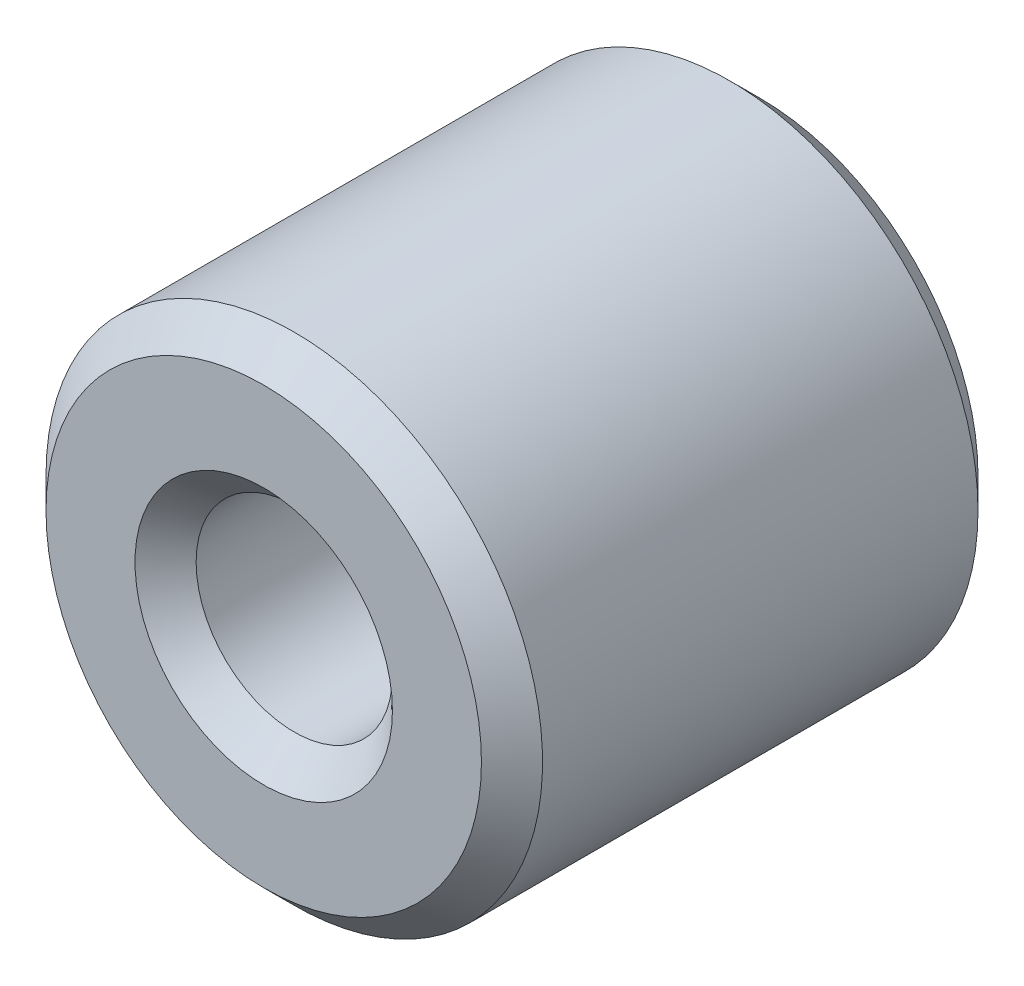
ISO-10303-21;
HEADER;
FILE_DESCRIPTION(('STEP AP214'),'2;1');
FILE_NAME('part.step','',(''),(''),'','','');
FILE_SCHEMA(('AUTOMOTIVE_DESIGN { 1 0 10303 214 1 1 1 1 }'));
ENDSEC;
DATA;
#1=APPLICATION_CONTEXT('core data for automotive mechanical design processes');
#2=APPLICATION_PROTOCOL_DEFINITION('international standard','automotive_design',2000,#1);
#3=PRODUCT_CONTEXT('',#1,'mechanical');
#4=PRODUCT('Part','Part','',(#3));
#5=PRODUCT_RELATED_PRODUCT_CATEGORY('part','',(#4));
#6=PRODUCT_DEFINITION_FORMATION('','',#4);
#7=PRODUCT_DEFINITION_CONTEXT('part definition',#1,'design');
#8=PRODUCT_DEFINITION('design','',#6,#7);
#9=PRODUCT_DEFINITION_SHAPE('','',#8);
#10=(LENGTH_UNIT() NAMED_UNIT(*) SI_UNIT(.MILLI.,.METRE.));
#11=(NAMED_UNIT(*) PLANE_ANGLE_UNIT() SI_UNIT($,.RADIAN.));
#12=(NAMED_UNIT(*) SI_UNIT($,.STERADIAN.) SOLID_ANGLE_UNIT());
#13=UNCERTAINTY_MEASURE_WITH_UNIT(LENGTH_MEASURE(1.E-05),#10,'distance_accuracy_value','');
#14=(GEOMETRIC_REPRESENTATION_CONTEXT(3) GLOBAL_UNCERTAINTY_ASSIGNED_CONTEXT((#13)) GLOBAL_UNIT_ASSIGNED_CONTEXT((#10,
#11,#12)) REPRESENTATION_CONTEXT('',''));
#15=CARTESIAN_POINT('',(0.,0.,0.));
#16=DIRECTION('',(0.,0.,1.));
#17=DIRECTION('',(1.,0.,0.));
#18=AXIS2_PLACEMENT_3D('',#15,#16,#17);
#19=CARTESIAN_POINT('',(0.,0.,13.));
#20=DIRECTION('',(0.,0.,-1.));
#21=DIRECTION('',(-1.,0.,0.));
#22=AXIS2_PLACEMENT_3D('',#19,#20,#21);
#23=CYLINDRICAL_SURFACE('',#22,2.57);
#24=CARTESIAN_POINT('',(0.,0.,0.800000000026557));
#25=DIRECTION('',(0.,0.,-1.));
#26=DIRECTION('',(-1.,0.,0.));
#27=AXIS2_PLACEMENT_3D('',#24,#25,#26);
#28=CIRCLE('',#27,2.56999999999152);
#29=CARTESIAN_POINT('',(-2.56999999999152,0.,0.800000000026557));
#30=VERTEX_POINT('',#29);
#31=EDGE_CURVE('E30',#30,#30,#28,.T.);
#32=ORIENTED_EDGE('',*,*,#31,.T.);
#33=EDGE_LOOP('',(#32));
#34=FACE_BOUND('',#33,.T.);
#35=CARTESIAN_POINT('',(0.,0.,12.2000000000071));
#36=DIRECTION('',(0.,0.,1.));
#37=DIRECTION('',(1.,0.,0.));
#38=AXIS2_PLACEMENT_3D('',#35,#36,#37);
#39=CIRCLE('',#38,2.56999999999152);
#40=CARTESIAN_POINT('',(2.56999999999152,0.,12.2000000000071));
#41=VERTEX_POINT('',#40);
#42=EDGE_CURVE('E33',#41,#41,#39,.T.);
#43=ORIENTED_EDGE('',*,*,#42,.T.);
#44=EDGE_LOOP('',(#43));
#45=FACE_BOUND('',#44,.T.);
#46=ADVANCED_FACE('F15',(#34,#45),#23,.F.);
#47=CARTESIAN_POINT('',(0.,0.,12.9999999999768));
#48=DIRECTION('',(0.,0.,1.));
#49=DIRECTION('',(1.,0.,0.));
#50=AXIS2_PLACEMENT_3D('',#47,#48,#49);
#51=CONICAL_SURFACE('',#50,3.36999999996124,0.785398163397448);
#52=ORIENTED_EDGE('',*,*,#42,.F.);
#53=EDGE_LOOP('',(#52));
#54=FACE_BOUND('',#53,.T.);
#55=CARTESIAN_POINT('',(0.,0.,12.9999999999768));
#56=DIRECTION('',(0.,0.,1.));
#57=DIRECTION('',(1.,0.,0.));
#58=AXIS2_PLACEMENT_3D('',#55,#56,#57);
#59=CIRCLE('',#58,3.36999999996124);
#60=CARTESIAN_POINT('',(3.36999999996124,0.,12.9999999999768));
#61=VERTEX_POINT('',#60);
#62=EDGE_CURVE('E18',#61,#61,#59,.F.);
#63=ORIENTED_EDGE('',*,*,#62,.F.);
#64=EDGE_LOOP('',(#63));
#65=FACE_BOUND('',#64,.T.);
#66=ADVANCED_FACE('F49',(#54,#65),#51,.F.);
#67=CARTESIAN_POINT('',(0.,0.,1.13686837721616E-10));
#68=DIRECTION('',(0.,0.,-1.));
#69=DIRECTION('',(-1.,0.,0.));
#70=AXIS2_PLACEMENT_3D('',#67,#68,#69);
#71=CONICAL_SURFACE('',#70,3.36999999990439,0.785398163397448);
#72=CARTESIAN_POINT('',(0.,0.,5.6843418860808E-11));
#73=DIRECTION('',(0.,0.,-1.));
#74=DIRECTION('',(-1.,0.,0.));
#75=AXIS2_PLACEMENT_3D('',#72,#73,#74);
#76=CIRCLE('',#75,3.36999999996124);
#77=CARTESIAN_POINT('',(-3.36999999996124,0.,5.6843418860808E-11));
#78=VERTEX_POINT('',#77);
#79=EDGE_CURVE('E40',#78,#78,#76,.T.);
#80=ORIENTED_EDGE('',*,*,#79,.T.);
#81=EDGE_LOOP('',(#80));
#82=FACE_BOUND('',#81,.T.);
#83=ORIENTED_EDGE('',*,*,#31,.F.);
#84=EDGE_LOOP('',(#83));
#85=FACE_BOUND('',#84,.T.);
#86=ADVANCED_FACE('F51',(#82,#85),#71,.F.);
#87=CARTESIAN_POINT('',(0.,0.,13.));
#88=DIRECTION('',(0.,0.,1.));
#89=DIRECTION('',(1.,0.,0.));
#90=AXIS2_PLACEMENT_3D('',#87,#88,#89);
#91=PLANE('',#90);
#92=CARTESIAN_POINT('',(0.,0.,12.9999999999768));
#93=DIRECTION('',(0.,0.,-1.));
#94=DIRECTION('',(-1.,0.,0.));
#95=AXIS2_PLACEMENT_3D('',#92,#93,#94);
#96=CIRCLE('',#95,5.69999999993342);
#97=CARTESIAN_POINT('',(-5.69999999993342,0.,12.9999999999768));
#98=VERTEX_POINT('',#97);
#99=EDGE_CURVE('E38',#98,#98,#96,.T.);
#100=ORIENTED_EDGE('',*,*,#99,.F.);
#101=EDGE_LOOP('',(#100));
#102=FACE_BOUND('',#101,.T.);
#103=ORIENTED_EDGE('',*,*,#62,.T.);
#104=EDGE_LOOP('',(#103));
#105=FACE_BOUND('',#104,.T.);
#106=ADVANCED_FACE('F47',(#102,#105),#91,.T.);
#107=CARTESIAN_POINT('',(0.,0.,0.));
#108=DIRECTION('',(0.,0.,1.));
#109=DIRECTION('',(1.,0.,0.));
#110=AXIS2_PLACEMENT_3D('',#107,#108,#109);
#111=PLANE('',#110);
#112=CARTESIAN_POINT('',(0.,0.,0.));
#113=DIRECTION('',(0.,0.,1.));
#114=DIRECTION('',(1.,0.,0.));
#115=AXIS2_PLACEMENT_3D('',#112,#113,#114);
#116=CIRCLE('',#115,5.69999999999027);
#117=CARTESIAN_POINT('',(5.69999999999027,0.,0.));
#118=VERTEX_POINT('',#117);
#119=EDGE_CURVE('E27',#118,#118,#116,.T.);
#120=ORIENTED_EDGE('',*,*,#119,.F.);
#121=EDGE_LOOP('',(#120));
#122=FACE_BOUND('',#121,.T.);
#123=ORIENTED_EDGE('',*,*,#79,.F.);
#124=EDGE_LOOP('',(#123));
#125=FACE_BOUND('',#124,.T.);
#126=ADVANCED_FACE('F76',(#122,#125),#111,.F.);
#127=CARTESIAN_POINT('',(0.,0.,12.2000000000639));
#128=DIRECTION('',(0.,0.,-1.));
#129=DIRECTION('',(-1.,0.,0.));
#130=AXIS2_PLACEMENT_3D('',#127,#128,#129);
#131=CONICAL_SURFACE('',#130,6.4999999998463,0.785398163397448);
#132=CARTESIAN_POINT('',(0.,0.,12.2));
#133=DIRECTION('',(0.,0.,-1.));
#134=DIRECTION('',(-1.,0.,0.));
#135=AXIS2_PLACEMENT_3D('',#132,#133,#134);
#136=CIRCLE('',#135,6.5);
#137=CARTESIAN_POINT('',(-6.5,0.,12.2));
#138=VERTEX_POINT('',#137);
#139=EDGE_CURVE('E22',#138,#138,#136,.T.);
#140=ORIENTED_EDGE('',*,*,#139,.F.);
#141=EDGE_LOOP('',(#140));
#142=FACE_BOUND('',#141,.T.);
#143=ORIENTED_EDGE('',*,*,#99,.T.);
#144=EDGE_LOOP('',(#143));
#145=FACE_BOUND('',#144,.T.);
#146=ADVANCED_FACE('F69',(#142,#145),#131,.T.);
#147=CARTESIAN_POINT('',(0.,0.,0.800000000083401));
#148=DIRECTION('',(0.,0.,1.));
#149=DIRECTION('',(1.,0.,0.));
#150=AXIS2_PLACEMENT_3D('',#147,#148,#149);
#151=CONICAL_SURFACE('',#150,6.50000000001683,0.785398163361921);
#152=CARTESIAN_POINT('',(0.,0.,0.800000000000012));
#153=DIRECTION('',(0.,0.,-1.));
#154=DIRECTION('',(-1.,0.,0.));
#155=AXIS2_PLACEMENT_3D('',#152,#153,#154);
#156=CIRCLE('',#155,6.5);
#157=CARTESIAN_POINT('',(-6.5,0.,0.800000000000012));
#158=VERTEX_POINT('',#157);
#159=EDGE_CURVE('E10',#158,#158,#156,.F.);
#160=ORIENTED_EDGE('',*,*,#159,.F.);
#161=EDGE_LOOP('',(#160));
#162=FACE_BOUND('',#161,.T.);
#163=ORIENTED_EDGE('',*,*,#119,.T.);
#164=EDGE_LOOP('',(#163));
#165=FACE_BOUND('',#164,.T.);
#166=ADVANCED_FACE('F64',(#162,#165),#151,.T.);
#167=CARTESIAN_POINT('',(0.,0.,13.));
#168=DIRECTION('',(0.,0.,-1.));
#169=DIRECTION('',(-1.,0.,0.));
#170=AXIS2_PLACEMENT_3D('',#167,#168,#169);
#171=CYLINDRICAL_SURFACE('',#170,6.5);
#172=ORIENTED_EDGE('',*,*,#159,.T.);
#173=EDGE_LOOP('',(#172));
#174=FACE_BOUND('',#173,.T.);
#175=ORIENTED_EDGE('',*,*,#139,.T.);
#176=EDGE_LOOP('',(#175));
#177=FACE_BOUND('',#176,.T.);
#178=ADVANCED_FACE('F62',(#174,#177),#171,.T.);
#179=CLOSED_SHELL('',(#46,#66,#86,#106,#126,#146,#166,#178));
#180=MANIFOLD_SOLID_BREP('B1',#179);
#181=ADVANCED_BREP_SHAPE_REPRESENTATION('',(#18,#180),#14);
#182=SHAPE_DEFINITION_REPRESENTATION(#9,#181);
ENDSEC;
END-ISO-10303-21;
